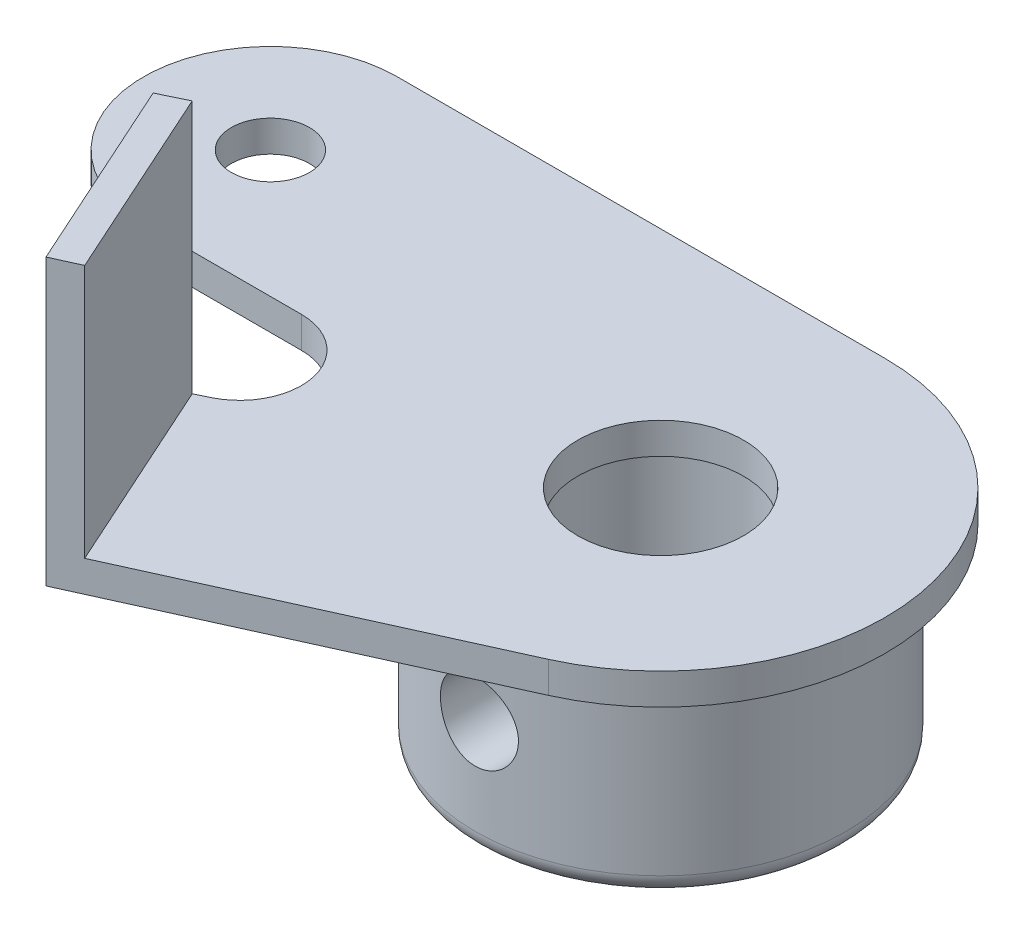
ISO-10303-21;
HEADER;
FILE_DESCRIPTION(('STEP AP214'),'2;1');
FILE_NAME('part.step','',(''),(''),'','','');
FILE_SCHEMA(('AUTOMOTIVE_DESIGN { 1 0 10303 214 1 1 1 1 }'));
ENDSEC;
DATA;
#1=APPLICATION_CONTEXT('core data for automotive mechanical design processes');
#2=APPLICATION_PROTOCOL_DEFINITION('international standard','automotive_design',2000,#1);
#3=PRODUCT_CONTEXT('',#1,'mechanical');
#4=PRODUCT('Part','Part','',(#3));
#5=PRODUCT_RELATED_PRODUCT_CATEGORY('part','',(#4));
#6=PRODUCT_DEFINITION_FORMATION('','',#4);
#7=PRODUCT_DEFINITION_CONTEXT('part definition',#1,'design');
#8=PRODUCT_DEFINITION('design','',#6,#7);
#9=PRODUCT_DEFINITION_SHAPE('','',#8);
#10=(LENGTH_UNIT() NAMED_UNIT(*) SI_UNIT(.MILLI.,.METRE.));
#11=(NAMED_UNIT(*) PLANE_ANGLE_UNIT() SI_UNIT($,.RADIAN.));
#12=(NAMED_UNIT(*) SI_UNIT($,.STERADIAN.) SOLID_ANGLE_UNIT());
#13=UNCERTAINTY_MEASURE_WITH_UNIT(LENGTH_MEASURE(1.E-05),#10,'distance_accuracy_value','');
#14=(GEOMETRIC_REPRESENTATION_CONTEXT(3) GLOBAL_UNCERTAINTY_ASSIGNED_CONTEXT((#13)) GLOBAL_UNIT_ASSIGNED_CONTEXT((#10,
#11,#12)) REPRESENTATION_CONTEXT('',''));
#15=CARTESIAN_POINT('',(0.,0.,0.));
#16=DIRECTION('',(0.,0.,1.));
#17=DIRECTION('',(1.,0.,0.));
#18=AXIS2_PLACEMENT_3D('',#15,#16,#17);
#19=CARTESIAN_POINT('',(0.,-9.9,0.));
#20=DIRECTION('',(0.,1.,0.));
#21=DIRECTION('',(0.,0.,1.));
#22=AXIS2_PLACEMENT_3D('',#19,#20,#21);
#23=CYLINDRICAL_SURFACE('',#22,9.5);
#24=CARTESIAN_POINT('',(0.,0.,0.));
#25=DIRECTION('',(0.,1.,0.));
#26=DIRECTION('',(0.,0.,1.));
#27=AXIS2_PLACEMENT_3D('',#24,#25,#26);
#28=CIRCLE('',#27,9.5);
#29=CARTESIAN_POINT('',(0.,0.,9.5));
#30=VERTEX_POINT('',#29);
#31=EDGE_CURVE('E180',#30,#30,#28,.T.);
#32=ORIENTED_EDGE('',*,*,#31,.F.);
#33=EDGE_LOOP('',(#32));
#34=FACE_BOUND('',#33,.T.);
#35=CARTESIAN_POINT('',(0.,-8.9,0.));
#36=DIRECTION('',(0.,1.,0.));
#37=DIRECTION('',(0.,0.,1.));
#38=AXIS2_PLACEMENT_3D('',#35,#36,#37);
#39=CIRCLE('',#38,9.5);
#40=CARTESIAN_POINT('',(0.,-8.9,9.5));
#41=VERTEX_POINT('',#40);
#42=EDGE_CURVE('E54',#41,#41,#39,.T.);
#43=ORIENTED_EDGE('',*,*,#42,.T.);
#44=EDGE_LOOP('',(#43));
#45=FACE_BOUND('',#44,.T.);
#46=CARTESIAN_POINT('',(0.,-6.,9.5));
#47=CARTESIAN_POINT('',(-0.111027691406918,-5.99999607124184,9.49999794466284));
#48=CARTESIAN_POINT('',(-0.222103819697907,-5.99072341258494,9.49803374011152));
#49=CARTESIAN_POINT('',(-0.441107897677742,-5.95391221577523,9.49038773876543));
#50=CARTESIAN_POINT('',(-0.549033421548031,-5.92635997129166,9.48470315241122));
#51=CARTESIAN_POINT('',(-0.758538954356631,-5.85388532469072,9.47025014436966));
#52=CARTESIAN_POINT('',(-0.860125227252474,-5.80898039524809,9.46148482551806));
#53=CARTESIAN_POINT('',(-1.05431669556347,-5.70312896009559,9.44181943917345));
#54=CARTESIAN_POINT('',(-1.14692225767425,-5.64218310973783,9.43091945889674));
#55=CARTESIAN_POINT('',(-1.32191105664779,-5.5050163164218,9.40799939900276));
#56=CARTESIAN_POINT('',(-1.40414098477697,-5.42860195147082,9.39596628673028));
#57=CARTESIAN_POINT('',(-1.5547158009156,-5.26308274811662,9.37222932526175));
#58=CARTESIAN_POINT('',(-1.62305952179987,-5.17397684406892,9.36052550381352));
#59=CARTESIAN_POINT('',(-1.74458761331518,-4.98448418595307,9.33864435582616));
#60=CARTESIAN_POINT('',(-1.79761077433325,-4.88399193875563,9.3284837610875));
#61=CARTESIAN_POINT('',(-1.88595912909311,-4.67527480153637,9.31102569552844));
#62=CARTESIAN_POINT('',(-1.92128627263874,-4.56705076492994,9.30372790929388));
#63=CARTESIAN_POINT('',(-1.97273711798377,-4.34759918793632,9.29295410063532));
#64=CARTESIAN_POINT('',(-1.98913117149676,-4.23643772602986,9.28942433018121));
#65=CARTESIAN_POINT('',(-2.00309070126667,-4.01289040972181,9.28642462929545));
#66=CARTESIAN_POINT('',(-2.0006583162811,-3.90050469584858,9.28695423770231));
#67=CARTESIAN_POINT('',(-1.97725203465241,-3.67969454311813,9.29196471678557));
#68=CARTESIAN_POINT('',(-1.95659032965632,-3.57123527450766,9.29637905513068));
#69=CARTESIAN_POINT('',(-1.89780570602233,-3.35935778687936,9.30855661318396));
#70=CARTESIAN_POINT('',(-1.85968187273537,-3.25593983223457,9.31632000831117));
#71=CARTESIAN_POINT('',(-1.76676342524457,-3.05619311586893,9.3343876042841));
#72=CARTESIAN_POINT('',(-1.71184711583088,-2.95992270171329,9.34471024508934));
#73=CARTESIAN_POINT('',(-1.58698828724243,-2.77784720736976,9.36672168799341));
#74=CARTESIAN_POINT('',(-1.51704386320572,-2.6920434560286,9.37841066319381));
#75=CARTESIAN_POINT('',(-1.36245319268555,-2.5315377182517,9.40212443418224));
#76=CARTESIAN_POINT('',(-1.27754103078861,-2.45709191372292,9.41415127237563));
#77=CARTESIAN_POINT('',(-1.09630350618647,-2.32345749428508,9.43697235772124));
#78=CARTESIAN_POINT('',(-0.999977965203844,-2.26426911774351,9.44776658561488));
#79=CARTESIAN_POINT('',(-0.798347946602956,-2.16277357067253,9.4669373217246));
#80=CARTESIAN_POINT('',(-0.693027080487019,-2.12049804546326,9.47530928967255));
#81=CARTESIAN_POINT('',(-0.476561722422704,-2.05431411167283,9.48865817597072));
#82=CARTESIAN_POINT('',(-0.36541801587004,-2.0304032328119,9.49363555092699));
#83=CARTESIAN_POINT('',(-0.142661179143838,-2.00199549360385,9.49957007213675));
#84=CARTESIAN_POINT('',(-0.0310945881093398,-1.9971484028368,9.50059973479178));
#85=CARTESIAN_POINT('',(0.191254168004883,-2.00605926966534,9.49872522451051));
#86=CARTESIAN_POINT('',(0.302036381746439,-2.01981606274954,9.49582129779749));
#87=CARTESIAN_POINT('',(0.518524951939024,-2.06525350407423,9.48645148769872));
#88=CARTESIAN_POINT('',(0.624271191689803,-2.0967522431248,9.48002177185877));
#89=CARTESIAN_POINT('',(0.828980163564159,-2.17657893621449,9.46431934896414));
#90=CARTESIAN_POINT('',(0.927942347168736,-2.22490824915882,9.45504641235425));
#91=CARTESIAN_POINT('',(1.1177352139125,-2.33776641280824,9.43450639350328));
#92=CARTESIAN_POINT('',(1.20843942082223,-2.40250330603654,9.42321429613729));
#93=CARTESIAN_POINT('',(1.3778228093732,-2.5460629854693,9.39994292264559));
#94=CARTESIAN_POINT('',(1.45650054987901,-2.62488745734182,9.38796356440136));
#95=CARTESIAN_POINT('',(1.60096761890465,-2.7959863577544,9.36442002668555));
#96=CARTESIAN_POINT('',(1.66651533299618,-2.88846649855883,9.35286635532256));
#97=CARTESIAN_POINT('',(1.78114871532168,-3.08332921929841,9.3317158615554));
#98=CARTESIAN_POINT('',(1.83023507526625,-3.1857113829149,9.32211895693401));
#99=CARTESIAN_POINT('',(1.91023404895235,-3.39693504714075,9.30605568943114));
#100=CARTESIAN_POINT('',(1.94124569603787,-3.50573768219553,9.29957230236649));
#101=CARTESIAN_POINT('',(1.98450997561557,-3.72716231931549,9.29043690813401));
#102=CARTESIAN_POINT('',(1.99676535636039,-3.83978375935983,9.2877843396606));
#103=CARTESIAN_POINT('',(2.00205901839309,-4.06321772699636,9.28664441918933));
#104=CARTESIAN_POINT('',(1.99547977904067,-4.17402094367414,9.28807416506268));
#105=CARTESIAN_POINT('',(1.96414112828371,-4.39290256994455,9.29475130102582));
#106=CARTESIAN_POINT('',(1.93938189936145,-4.50098100687599,9.29999865279627));
#107=CARTESIAN_POINT('',(1.87256463307709,-4.71106838455512,9.31368082515299));
#108=CARTESIAN_POINT('',(1.83055834216923,-4.81309444519955,9.32210610488688));
#109=CARTESIAN_POINT('',(1.7304853373043,-5.00870903307655,9.34119928093713));
#110=CARTESIAN_POINT('',(1.67241709412298,-5.10229675578741,9.35186739076535));
#111=CARTESIAN_POINT('',(1.54058300352461,-5.28027215313688,9.37449454781844));
#112=CARTESIAN_POINT('',(1.46654292423916,-5.36445412742039,9.38647407045747));
#113=CARTESIAN_POINT('',(1.30542742412966,-5.51932471088921,9.41023256612317));
#114=CARTESIAN_POINT('',(1.21834900426412,-5.59001020712048,9.42201149231316));
#115=CARTESIAN_POINT('',(1.0323889870608,-5.71667699825411,9.44420645110714));
#116=CARTESIAN_POINT('',(0.933379984354338,-5.77247451681065,9.45460471891947));
#117=CARTESIAN_POINT('',(0.727194538068344,-5.86654901797898,9.47269018370409));
#118=CARTESIAN_POINT('',(0.620025269870786,-5.90484119029407,9.48037972974824));
#119=CARTESIAN_POINT('',(0.427239257105932,-5.95572669428031,9.49075437069452));
#120=CARTESIAN_POINT('',(0.34269090067951,-5.97229845081316,9.4942005429971));
#121=CARTESIAN_POINT('',(0.172104693356146,-5.99443641509507,9.49882411071615));
#122=CARTESIAN_POINT('',(0.0860668997910729,-6.00000304551082,9.50000159326466));
#123=CARTESIAN_POINT('',(0.,-6.,9.5));
#124=B_SPLINE_CURVE_WITH_KNOTS('',3,(#46,#47,#48,#49,#50,#51,#52,#53,#54,#55,#56,#57,#58,#59,
#60,#61,#62,#63,#64,#65,#66,#67,#68,#69,#70,#71,#72,#73,#74,#75,#76,#77,#78,#79,#80,#81,#82,#83,
#84,#85,#86,#87,#88,#89,#90,#91,#92,#93,#94,#95,#96,#97,#98,#99,#100,#101,#102,#103,#104,#105,
#106,#107,#108,#109,#110,#111,#112,#113,#114,#115,#116,#117,#118,#119,#120,#121,#122,#123),
.UNSPECIFIED.,.T.,.F.,(4,2,2,2,2,2,2,2,2,2,2,2,2,2,2,2,2,2,2,2,2,2,2,2,2,2,2,2,2,2,2,2,2,2,2,2,
2,2,4),(0.,0.332768117031277,0.665786031430695,0.998469495255918,1.33113936940165,
1.6682591973254,2.00540734820485,2.34598369082387,2.68652249939278,3.02213605752824,
3.35771148920196,3.68764911424788,4.01760402307771,4.35000918418411,4.68245650359801,
5.02154876866119,5.36064633105725,5.70037543797721,6.04005883898083,6.37347176163493,
6.7068638152502,7.03689822691305,7.36695929182639,7.70143535229664,8.03595146177539,
8.37614947767226,8.71633319656386,9.05463505055367,9.39288733028468,9.72431965754211,
10.0557486580815,10.3861904535976,10.7166637206083,11.0533410961237,11.3900960325031,
11.7308334079191,12.0712745555643,12.329241012877,12.5871975624483),.UNSPECIFIED.);
#125=CARTESIAN_POINT('',(0.,-6.,9.5));
#126=VERTEX_POINT('',#125);
#127=EDGE_CURVE('E168',#126,#126,#124,.T.);
#128=ORIENTED_EDGE('',*,*,#127,.T.);
#129=EDGE_LOOP('',(#128));
#130=FACE_BOUND('',#129,.T.);
#131=ADVANCED_FACE('F39',(#34,#45,#130),#23,.T.);
#132=CARTESIAN_POINT('',(0.,-9.9,0.));
#133=DIRECTION('',(0.,1.,0.));
#134=DIRECTION('',(0.,0.,1.));
#135=AXIS2_PLACEMENT_3D('',#132,#133,#134);
#136=CYLINDRICAL_SURFACE('',#135,4.5);
#137=CARTESIAN_POINT('',(0.,-9.9,0.));
#138=DIRECTION('',(0.,1.,0.));
#139=DIRECTION('',(0.,0.,1.));
#140=AXIS2_PLACEMENT_3D('',#137,#138,#139);
#141=CIRCLE('',#140,4.5);
#142=CARTESIAN_POINT('',(0.,-9.9,4.5));
#143=VERTEX_POINT('',#142);
#144=EDGE_CURVE('E176',#143,#143,#141,.T.);
#145=ORIENTED_EDGE('',*,*,#144,.F.);
#146=EDGE_LOOP('',(#145));
#147=FACE_BOUND('',#146,.T.);
#148=CARTESIAN_POINT('',(0.,0.,0.));
#149=DIRECTION('',(0.,1.,0.));
#150=DIRECTION('',(0.,0.,1.));
#151=AXIS2_PLACEMENT_3D('',#148,#149,#150);
#152=CIRCLE('',#151,4.5);
#153=CARTESIAN_POINT('',(0.,0.,4.5));
#154=VERTEX_POINT('',#153);
#155=EDGE_CURVE('E334',#154,#154,#152,.T.);
#156=ORIENTED_EDGE('',*,*,#155,.T.);
#157=EDGE_LOOP('',(#156));
#158=FACE_BOUND('',#157,.T.);
#159=CARTESIAN_POINT('',(0.,-6.,4.5));
#160=CARTESIAN_POINT('',(-0.106491721841544,-5.99999501758122,4.49999592201235));
#161=CARTESIAN_POINT('',(-0.21314990839859,-5.9914445549547,4.49617759862479));
#162=CARTESIAN_POINT('',(-0.423397791553031,-5.95758155510822,4.48128347117207));
#163=CARTESIAN_POINT('',(-0.52697948867481,-5.93222874127921,4.4701902292036));
#164=CARTESIAN_POINT('',(-0.727700457039998,-5.86589953450088,4.44192390608473));
#165=CARTESIAN_POINT('',(-0.824861278500743,-5.82497888321389,4.4247725319732));
#166=CARTESIAN_POINT('',(-1.01083182992513,-5.72892471805294,4.38602940690416));
#167=CARTESIAN_POINT('',(-1.09964345718941,-5.67379444393081,4.36443866833523));
#168=CARTESIAN_POINT('',(-1.27147987858137,-5.54766515992118,4.31759990391248));
#169=CARTESIAN_POINT('',(-1.35398160775404,-5.47600235690455,4.29222181537651));
#170=CARTESIAN_POINT('',(-1.50625667860228,-5.32025173671296,4.24118529786287));
#171=CARTESIAN_POINT('',(-1.57602243299506,-5.23615656675937,4.21552671136583));
#172=CARTESIAN_POINT('',(-1.70484606406972,-5.05206127800161,4.16516047349691));
#173=CARTESIAN_POINT('',(-1.76305311381034,-4.95142318568418,4.14059326444591));
#174=CARTESIAN_POINT('',(-1.86148058259834,-4.74054475309348,4.09729211094913));
#175=CARTESIAN_POINT('',(-1.90171150191227,-4.6303100634953,4.07855476309651));
#176=CARTESIAN_POINT('',(-1.96081152395391,-4.40937961957922,4.05046224857976));
#177=CARTESIAN_POINT('',(-1.98069316967171,-4.29901326559807,4.04066532542944));
#178=CARTESIAN_POINT('',(-2.00167828313022,-4.07611022983535,4.03031463933106));
#179=CARTESIAN_POINT('',(-2.00279429210704,-3.9635750478577,4.02975470323001));
#180=CARTESIAN_POINT('',(-1.98697164299089,-3.75030455137066,4.03757276711961));
#181=CARTESIAN_POINT('',(-1.97164003901053,-3.64941463083007,4.04515525710506));
#182=CARTESIAN_POINT('',(-1.92608101262575,-3.45182477504366,4.06704362044732));
#183=CARTESIAN_POINT('',(-1.89585024271053,-3.35512578672126,4.08135100470464));
#184=CARTESIAN_POINT('',(-1.82075207125291,-3.16606637226809,4.11540857141477));
#185=CARTESIAN_POINT('',(-1.77557135736335,-3.07385205485914,4.13527371795058));
#186=CARTESIAN_POINT('',(-1.67208117489408,-2.89792408552561,4.1781907832441));
#187=CARTESIAN_POINT('',(-1.61376617867147,-2.81421403425943,4.20124404215704));
#188=CARTESIAN_POINT('',(-1.47900808503927,-2.64908639852289,4.25066638916311));
#189=CARTESIAN_POINT('',(-1.40135242758352,-2.5686865215826,4.2771397203327));
#190=CARTESIAN_POINT('',(-1.23343821212405,-2.42168255644264,4.32854899612318));
#191=CARTESIAN_POINT('',(-1.14317585772422,-2.35508263904009,4.3534844743602));
#192=CARTESIAN_POINT('',(-0.949152758511854,-2.23578677227797,4.39992448973313));
#193=CARTESIAN_POINT('',(-0.84507203759896,-2.18355965680664,4.42130591930767));
#194=CARTESIAN_POINT('',(-0.628407422866467,-2.09772305008782,4.45725580673344));
#195=CARTESIAN_POINT('',(-0.515828940708057,-2.06410182177702,4.47182855876463));
#196=CARTESIAN_POINT('',(-0.293820535494528,-2.01868811731395,4.4916825843904));
#197=CARTESIAN_POINT('',(-0.184721163041697,-2.00553330274902,4.49754246102964));
#198=CARTESIAN_POINT('',(0.034277038790982,-1.99729687693117,4.5012000386526));
#199=CARTESIAN_POINT('',(0.144175583963884,-2.00220912686501,4.49900047806663));
#200=CARTESIAN_POINT('',(0.354907416738488,-2.02904357268083,4.48715295545649));
#201=CARTESIAN_POINT('',(0.455896417732649,-2.04996089251949,4.47794517757649));
#202=CARTESIAN_POINT('',(0.652792072958493,-2.10675797910305,4.45350542314086));
#203=CARTESIAN_POINT('',(0.748698107925826,-2.14263956426254,4.43827271446453));
#204=CARTESIAN_POINT('',(0.936104051933314,-2.2294888824104,4.40262377340665));
#205=CARTESIAN_POINT('',(1.02737315333644,-2.28089234711435,4.38206065228313));
#206=CARTESIAN_POINT('',(1.20031927875008,-2.39685142601791,4.33788123051325));
#207=CARTESIAN_POINT('',(1.28199210078393,-2.46141276814545,4.31426360181097));
#208=CARTESIAN_POINT('',(1.44036721253598,-2.60791677979857,4.26412793153243));
#209=CARTESIAN_POINT('',(1.5161383873979,-2.69084093748011,4.23752954099254));
#210=CARTESIAN_POINT('',(1.65300242266305,-2.86855534031592,4.18604134951667));
#211=CARTESIAN_POINT('',(1.71409007929176,-2.96334977419537,4.16115215653839));
#212=CARTESIAN_POINT('',(1.8210757313739,-3.16512430780775,4.11547790156447));
#213=CARTESIAN_POINT('',(1.86658327729173,-3.27233831636332,4.09480296069982));
#214=CARTESIAN_POINT('',(1.9384649201629,-3.4941268153095,4.06127502800889));
#215=CARTESIAN_POINT('',(1.96485774363289,-3.60869398173067,4.04841438258477));
#216=CARTESIAN_POINT('',(1.99578547827111,-3.83148157617779,4.03325053556433));
#217=CARTESIAN_POINT('',(2.00198344684389,-3.93941687852725,4.03014488230275));
#218=CARTESIAN_POINT('',(1.99690774864711,-4.15475960320147,4.03266289201163));
#219=CARTESIAN_POINT('',(1.9856378074246,-4.26216713318831,4.03828469359531));
#220=CARTESIAN_POINT('',(1.94740226605598,-4.46669192726576,4.056849647764));
#221=CARTESIAN_POINT('',(1.92142172220812,-4.56403951904575,4.06933199333214));
#222=CARTESIAN_POINT('',(1.85554194393926,-4.75298191903924,4.09978946876219));
#223=CARTESIAN_POINT('',(1.81563868559956,-4.84457505506902,4.11776618641145));
#224=CARTESIAN_POINT('',(1.72012109921673,-5.02583760828885,4.15861055539882));
#225=CARTESIAN_POINT('',(1.66366385858237,-5.11500764977681,4.18171780090031));
#226=CARTESIAN_POINT('',(1.53773594407697,-5.28312481334675,4.22964589951755));
#227=CARTESIAN_POINT('',(1.46825983476651,-5.36206764215037,4.25446746562723));
#228=CARTESIAN_POINT('',(1.31108140365532,-5.51462241319819,4.30563232874031));
#229=CARTESIAN_POINT('',(1.22231636253249,-5.58716396303648,4.33191880579014));
#230=CARTESIAN_POINT('',(1.03295134905358,-5.71643521702799,4.38093190708684));
#231=CARTESIAN_POINT('',(0.932345999936719,-5.77315769793594,4.40365690303547));
#232=CARTESIAN_POINT('',(0.723051823292369,-5.86822386265644,4.44279207455561));
#233=CARTESIAN_POINT('',(0.61446726176612,-5.90676811008318,4.45927074863036));
#234=CARTESIAN_POINT('',(0.391615018990365,-5.96463975047681,4.48431907433046));
#235=CARTESIAN_POINT('',(0.277365804280791,-5.98402576384635,4.49291284638178));
#236=CARTESIAN_POINT('',(0.135356670708527,-5.9955997263474,4.4980461865859));
#237=CARTESIAN_POINT('',(0.108319935768286,-5.99724828858674,4.49877760770441));
#238=CARTESIAN_POINT('',(0.0541923948081839,-5.99944906578034,4.49975503614401));
#239=CARTESIAN_POINT('',(0.0271015881639021,-6.00000126799961,4.5000010378266));
#240=CARTESIAN_POINT('',(0.,-6.,4.5));
#241=B_SPLINE_CURVE_WITH_KNOTS('',3,(#159,#160,#161,#162,#163,#164,#165,#166,#167,#168,#169,
#170,#171,#172,#173,#174,#175,#176,#177,#178,#179,#180,#181,#182,#183,#184,#185,#186,#187,#188,
#189,#190,#191,#192,#193,#194,#195,#196,#197,#198,#199,#200,#201,#202,#203,#204,#205,#206,#207,
#208,#209,#210,#211,#212,#213,#214,#215,#216,#217,#218,#219,#220,#221,#222,#223,#224,#225,#226,
#227,#228,#229,#230,#231,#232,#233,#234,#235,#236,#237,#238,#239,#240),.UNSPECIFIED.,.T.,.F.,(4,
2,2,2,2,2,2,2,2,2,2,2,2,2,2,2,2,2,2,2,2,2,2,2,2,2,2,2,2,2,2,2,2,2,2,2,2,2,2,2,4),(0.,
0.319363757820221,0.639495839039849,0.958492293098604,1.27741608114945,1.61253910860028,
1.9478611340991,2.30254396540812,2.65701934670053,2.99284475492684,3.32844571922349,
3.63400850030665,3.93963996586078,4.25213185320658,4.56475550123122,4.90783346749843,
5.25101497234173,5.6043339590265,5.95742980836633,6.28582812976761,6.61411487855049,
6.92332786204155,7.23257843116074,7.5514769554366,7.87051460127432,8.2152651666866,
8.56013773064322,8.9131101564671,9.26573630896653,9.58847399859333,9.91114286435878,
10.214399649514,10.5177441541184,10.8405269704428,11.1634448516016,11.5146101835415,
11.8659356017472,12.2132884514089,12.5595751486184,12.6408506163643,12.7221270281759),.UNSPECIFIED.);
#242=CARTESIAN_POINT('',(0.,-6.,4.5));
#243=VERTEX_POINT('',#242);
#244=EDGE_CURVE('E43',#243,#243,#241,.T.);
#245=ORIENTED_EDGE('',*,*,#244,.F.);
#246=EDGE_LOOP('',(#245));
#247=FACE_BOUND('',#246,.T.);
#248=ADVANCED_FACE('F254',(#147,#158,#247),#136,.F.);
#249=CARTESIAN_POINT('',(0.,0.,0.));
#250=DIRECTION('',(0.,1.,0.));
#251=DIRECTION('',(0.,0.,1.));
#252=AXIS2_PLACEMENT_3D('',#249,#250,#251);
#253=PLANE('',#252);
#254=CARTESIAN_POINT('',(0.,0.,0.));
#255=DIRECTION('',(0.,1.,0.));
#256=DIRECTION('',(0.,0.,1.));
#257=AXIS2_PLACEMENT_3D('',#254,#255,#256);
#258=CIRCLE('',#257,4.25);
#259=CARTESIAN_POINT('',(0.,0.,4.25));
#260=VERTEX_POINT('',#259);
#261=EDGE_CURVE('E186',#260,#260,#258,.T.);
#262=ORIENTED_EDGE('',*,*,#261,.T.);
#263=EDGE_LOOP('',(#262));
#264=FACE_BOUND('',#263,.T.);
#265=ORIENTED_EDGE('',*,*,#155,.F.);
#266=EDGE_LOOP('',(#265));
#267=FACE_BOUND('',#266,.T.);
#268=ADVANCED_FACE('F256',(#264,#267),#253,.F.);
#269=CARTESIAN_POINT('',(0.,1.6,0.));
#270=DIRECTION('',(0.,1.,0.));
#271=DIRECTION('',(0.,0.,1.));
#272=AXIS2_PLACEMENT_3D('',#269,#270,#271);
#273=PLANE('',#272);
#274=DIRECTION('',(-0.412042177364769,0.,-0.911164773283351));
#275=VECTOR('',#274,1.);
#276=CARTESIAN_POINT('',(-16.1820359982028,1.6,7.82423700244424));
#277=LINE('',#276,#275);
#278=CARTESIAN_POINT('',(-11.6337033913184,1.6,17.8821404798842));
#279=VERTEX_POINT('',#278);
#280=CARTESIAN_POINT('',(-16.1820359982028,1.6,7.82423700244424));
#281=VERTEX_POINT('',#280);
#282=EDGE_CURVE('E62',#279,#281,#277,.T.);
#283=ORIENTED_EDGE('',*,*,#282,.F.);
#284=DIRECTION('',(0.911164773283351,0.,-0.412042177364769));
#285=VECTOR('',#284,1.);
#286=CARTESIAN_POINT('',(4.73848503969484,1.6,10.4783948927585));
#287=LINE('',#286,#285);
#288=CARTESIAN_POINT('',(4.73848503969484,1.6,10.4783948927585));
#289=VERTEX_POINT('',#288);
#290=EDGE_CURVE('E67',#279,#289,#287,.T.);
#291=ORIENTED_EDGE('',*,*,#290,.T.);
#292=CARTESIAN_POINT('',(0.,1.6,0.));
#293=DIRECTION('',(0.,1.,0.));
#294=DIRECTION('',(0.,0.,1.));
#295=AXIS2_PLACEMENT_3D('',#292,#293,#294);
#296=CIRCLE('',#295,11.5);
#297=CARTESIAN_POINT('',(0.,1.6,-11.5));
#298=VERTEX_POINT('',#297);
#299=EDGE_CURVE('E199',#289,#298,#296,.T.);
#300=ORIENTED_EDGE('',*,*,#299,.T.);
#301=DIRECTION('',(-1.,0.,0.));
#302=VECTOR('',#301,1.);
#303=CARTESIAN_POINT('',(0.,1.6,-11.5));
#304=LINE('',#303,#302);
#305=CARTESIAN_POINT('',(-25.,1.6,-11.5));
#306=VERTEX_POINT('',#305);
#307=EDGE_CURVE('E110',#298,#306,#304,.T.);
#308=ORIENTED_EDGE('',*,*,#307,.T.);
#309=CARTESIAN_POINT('',(-25.,1.6,-4.99999999999999));
#310=DIRECTION('',(0.,1.,0.));
#311=DIRECTION('',(0.,0.,1.));
#312=AXIS2_PLACEMENT_3D('',#309,#310,#311);
#313=CIRCLE('',#312,6.50000000000001);
#314=CARTESIAN_POINT('',(-25.,1.6,1.50000000000001));
#315=VERTEX_POINT('',#314);
#316=EDGE_CURVE('E128',#306,#315,#313,.T.);
#317=ORIENTED_EDGE('',*,*,#316,.T.);
#318=DIRECTION('',(1.,0.,0.));
#319=VECTOR('',#318,1.);
#320=CARTESIAN_POINT('',(-25.,1.6,1.50000000000001));
#321=LINE('',#320,#319);
#322=CARTESIAN_POINT('',(-16.9092175399438,1.6,1.50000000000001));
#323=VERTEX_POINT('',#322);
#324=EDGE_CURVE('E120',#315,#323,#321,.T.);
#325=ORIENTED_EDGE('',*,*,#324,.T.);
#326=CARTESIAN_POINT('',(-16.9092175399438,1.6,4.66276717832938));
#327=DIRECTION('',(0.,-1.,0.));
#328=DIRECTION('',(0.,0.,-1.));
#329=AXIS2_PLACEMENT_3D('',#326,#327,#328);
#330=CIRCLE('',#329,3.16276717832936);
#331=CARTESIAN_POINT('',(-15.5324639510125,1.6,7.51015998222599));
#332=VERTEX_POINT('',#331);
#333=EDGE_CURVE('E125',#323,#332,#330,.T.);
#334=ORIENTED_EDGE('',*,*,#333,.T.);
#335=DIRECTION('',(-0.90028530187311,0.,0.435300327625931));
#336=VECTOR('',#335,1.);
#337=CARTESIAN_POINT('',(-15.5324639510125,1.6,7.51015998222599));
#338=LINE('',#337,#336);
#339=EDGE_CURVE('E149',#332,#281,#338,.T.);
#340=ORIENTED_EDGE('',*,*,#339,.T.);
#341=EDGE_LOOP('',(#283,#291,#300,#308,#317,#325,#334,#340));
#342=FACE_BOUND('',#341,.T.);
#343=CARTESIAN_POINT('',(-25.,1.6,-4.99999999999999));
#344=DIRECTION('',(0.,1.,0.));
#345=DIRECTION('',(0.,0.,1.));
#346=AXIS2_PLACEMENT_3D('',#343,#344,#345);
#347=CIRCLE('',#346,2.);
#348=CARTESIAN_POINT('',(-25.,1.6,-2.99999999999999));
#349=VERTEX_POINT('',#348);
#350=EDGE_CURVE('E182',#349,#349,#347,.T.);
#351=ORIENTED_EDGE('',*,*,#350,.F.);
#352=EDGE_LOOP('',(#351));
#353=FACE_BOUND('',#352,.T.);
#354=CARTESIAN_POINT('',(0.,1.6,0.));
#355=DIRECTION('',(0.,1.,0.));
#356=DIRECTION('',(0.,0.,1.));
#357=AXIS2_PLACEMENT_3D('',#354,#355,#356);
#358=CIRCLE('',#357,4.25);
#359=CARTESIAN_POINT('',(0.,1.6,4.25));
#360=VERTEX_POINT('',#359);
#361=EDGE_CURVE('E191',#360,#360,#358,.T.);
#362=ORIENTED_EDGE('',*,*,#361,.F.);
#363=EDGE_LOOP('',(#362));
#364=FACE_BOUND('',#363,.T.);
#365=ADVANCED_FACE('F122',(#342,#353,#364),#273,.T.);
#366=ORIENTED_EDGE('',*,*,#31,.T.);
#367=EDGE_LOOP('',(#366));
#368=FACE_BOUND('',#367,.T.);
#369=CARTESIAN_POINT('',(0.,0.,0.));
#370=DIRECTION('',(0.,1.,0.));
#371=DIRECTION('',(0.,0.,1.));
#372=AXIS2_PLACEMENT_3D('',#369,#370,#371);
#373=CIRCLE('',#372,11.5);
#374=CARTESIAN_POINT('',(4.73848503969484,0.,10.4783948927585));
#375=VERTEX_POINT('',#374);
#376=CARTESIAN_POINT('',(0.,0.,-11.5));
#377=VERTEX_POINT('',#376);
#378=EDGE_CURVE('E195',#375,#377,#373,.T.);
#379=ORIENTED_EDGE('',*,*,#378,.F.);
#380=DIRECTION('',(0.911164773283351,0.,-0.412042177364769));
#381=VECTOR('',#380,1.);
#382=CARTESIAN_POINT('',(4.73848503969484,0.,10.4783948927585));
#383=LINE('',#382,#381);
#384=CARTESIAN_POINT('',(-13.,0.,18.5));
#385=VERTEX_POINT('',#384);
#386=EDGE_CURVE('E101',#385,#375,#383,.T.);
#387=ORIENTED_EDGE('',*,*,#386,.F.);
#388=DIRECTION('',(0.412042177364769,0.,0.911164773283351));
#389=VECTOR('',#388,1.);
#390=CARTESIAN_POINT('',(-17.5324639510125,0.,8.47718749388314));
#391=LINE('',#390,#389);
#392=CARTESIAN_POINT('',(-17.5324639510125,0.,8.47718749388314));
#393=VERTEX_POINT('',#392);
#394=EDGE_CURVE('E206',#393,#385,#391,.T.);
#395=ORIENTED_EDGE('',*,*,#394,.F.);
#396=DIRECTION('',(-0.90028530187311,0.,0.435300327625931));
#397=VECTOR('',#396,1.);
#398=CARTESIAN_POINT('',(-15.5324639510125,0.,7.51015998222599));
#399=LINE('',#398,#397);
#400=CARTESIAN_POINT('',(-15.5324639510125,0.,7.51015998222599));
#401=VERTEX_POINT('',#400);
#402=EDGE_CURVE('E209',#401,#393,#399,.T.);
#403=ORIENTED_EDGE('',*,*,#402,.F.);
#404=CARTESIAN_POINT('',(-16.9092175399438,0.,4.66276717832938));
#405=DIRECTION('',(0.,-1.,0.));
#406=DIRECTION('',(0.,0.,-1.));
#407=AXIS2_PLACEMENT_3D('',#404,#405,#406);
#408=CIRCLE('',#407,3.16276717832936);
#409=CARTESIAN_POINT('',(-16.9092175399438,0.,1.50000000000001));
#410=VERTEX_POINT('',#409);
#411=EDGE_CURVE('E212',#410,#401,#408,.T.);
#412=ORIENTED_EDGE('',*,*,#411,.F.);
#413=DIRECTION('',(1.,0.,0.));
#414=VECTOR('',#413,1.);
#415=CARTESIAN_POINT('',(-25.,0.,1.50000000000001));
#416=LINE('',#415,#414);
#417=CARTESIAN_POINT('',(-25.,0.,1.50000000000001));
#418=VERTEX_POINT('',#417);
#419=EDGE_CURVE('E138',#418,#410,#416,.T.);
#420=ORIENTED_EDGE('',*,*,#419,.F.);
#421=CARTESIAN_POINT('',(-25.,0.,-4.99999999999999));
#422=DIRECTION('',(0.,1.,0.));
#423=DIRECTION('',(0.,0.,1.));
#424=AXIS2_PLACEMENT_3D('',#421,#422,#423);
#425=CIRCLE('',#424,6.50000000000001);
#426=CARTESIAN_POINT('',(-25.,0.,-11.5));
#427=VERTEX_POINT('',#426);
#428=EDGE_CURVE('E217',#427,#418,#425,.T.);
#429=ORIENTED_EDGE('',*,*,#428,.F.);
#430=DIRECTION('',(-1.,0.,0.));
#431=VECTOR('',#430,1.);
#432=CARTESIAN_POINT('',(0.,0.,-11.5));
#433=LINE('',#432,#431);
#434=EDGE_CURVE('E220',#377,#427,#433,.T.);
#435=ORIENTED_EDGE('',*,*,#434,.F.);
#436=EDGE_LOOP('',(#379,#387,#395,#403,#412,#420,#429,#435));
#437=FACE_BOUND('',#436,.T.);
#438=CARTESIAN_POINT('',(-25.,0.,-4.99999999999999));
#439=DIRECTION('',(0.,1.,0.));
#440=DIRECTION('',(0.,0.,1.));
#441=AXIS2_PLACEMENT_3D('',#438,#439,#440);
#442=CIRCLE('',#441,2.);
#443=CARTESIAN_POINT('',(-25.,0.,-2.99999999999999));
#444=VERTEX_POINT('',#443);
#445=EDGE_CURVE('E187',#444,#444,#442,.T.);
#446=ORIENTED_EDGE('',*,*,#445,.T.);
#447=EDGE_LOOP('',(#446));
#448=FACE_BOUND('',#447,.T.);
#449=ADVANCED_FACE('F264',(#368,#437,#448),#253,.F.);
#450=CARTESIAN_POINT('',(0.,1.6,0.));
#451=DIRECTION('',(0.,-1.,0.));
#452=DIRECTION('',(0.,0.,-1.));
#453=AXIS2_PLACEMENT_3D('',#450,#451,#452);
#454=CYLINDRICAL_SURFACE('',#453,11.5);
#455=ORIENTED_EDGE('',*,*,#378,.T.);
#456=DIRECTION('',(0.,-1.,0.));
#457=VECTOR('',#456,1.);
#458=CARTESIAN_POINT('',(0.,1.6,-11.5));
#459=LINE('',#458,#457);
#460=EDGE_CURVE('E331',#298,#377,#459,.T.);
#461=ORIENTED_EDGE('',*,*,#460,.F.);
#462=ORIENTED_EDGE('',*,*,#299,.F.);
#463=DIRECTION('',(0.,-1.,0.));
#464=VECTOR('',#463,1.);
#465=CARTESIAN_POINT('',(4.73848503969484,1.6,10.4783948927585));
#466=LINE('',#465,#464);
#467=EDGE_CURVE('E163',#289,#375,#466,.T.);
#468=ORIENTED_EDGE('',*,*,#467,.T.);
#469=EDGE_LOOP('',(#455,#461,#462,#468));
#470=FACE_BOUND('',#469,.T.);
#471=ADVANCED_FACE('F426',(#470),#454,.T.);
#472=CARTESIAN_POINT('',(0.,1.6,-11.5));
#473=DIRECTION('',(0.,0.,1.));
#474=DIRECTION('',(1.,0.,0.));
#475=AXIS2_PLACEMENT_3D('',#472,#473,#474);
#476=PLANE('',#475);
#477=ORIENTED_EDGE('',*,*,#434,.T.);
#478=DIRECTION('',(0.,-1.,0.));
#479=VECTOR('',#478,1.);
#480=CARTESIAN_POINT('',(-25.,1.6,-11.5));
#481=LINE('',#480,#479);
#482=EDGE_CURVE('E327',#306,#427,#481,.T.);
#483=ORIENTED_EDGE('',*,*,#482,.F.);
#484=ORIENTED_EDGE('',*,*,#307,.F.);
#485=ORIENTED_EDGE('',*,*,#460,.T.);
#486=EDGE_LOOP('',(#477,#483,#484,#485));
#487=FACE_BOUND('',#486,.T.);
#488=ADVANCED_FACE('F432',(#487),#476,.F.);
#489=CARTESIAN_POINT('',(-25.,1.6,-4.99999999999999));
#490=DIRECTION('',(0.,-1.,0.));
#491=DIRECTION('',(0.,0.,-1.));
#492=AXIS2_PLACEMENT_3D('',#489,#490,#491);
#493=CYLINDRICAL_SURFACE('',#492,6.50000000000001);
#494=ORIENTED_EDGE('',*,*,#428,.T.);
#495=DIRECTION('',(0.,-1.,0.));
#496=VECTOR('',#495,1.);
#497=CARTESIAN_POINT('',(-25.,1.6,1.50000000000001));
#498=LINE('',#497,#496);
#499=EDGE_CURVE('E142',#315,#418,#498,.T.);
#500=ORIENTED_EDGE('',*,*,#499,.F.);
#501=ORIENTED_EDGE('',*,*,#316,.F.);
#502=ORIENTED_EDGE('',*,*,#482,.T.);
#503=EDGE_LOOP('',(#494,#500,#501,#502));
#504=FACE_BOUND('',#503,.T.);
#505=ADVANCED_FACE('F439',(#504),#493,.T.);
#506=CARTESIAN_POINT('',(-25.,1.6,1.50000000000001));
#507=DIRECTION('',(0.,0.,-1.));
#508=DIRECTION('',(-1.,0.,0.));
#509=AXIS2_PLACEMENT_3D('',#506,#507,#508);
#510=PLANE('',#509);
#511=ORIENTED_EDGE('',*,*,#419,.T.);
#512=DIRECTION('',(0.,-1.,0.));
#513=VECTOR('',#512,1.);
#514=CARTESIAN_POINT('',(-16.9092175399438,1.6,1.50000000000001));
#515=LINE('',#514,#513);
#516=EDGE_CURVE('E135',#323,#410,#515,.T.);
#517=ORIENTED_EDGE('',*,*,#516,.F.);
#518=ORIENTED_EDGE('',*,*,#324,.F.);
#519=ORIENTED_EDGE('',*,*,#499,.T.);
#520=EDGE_LOOP('',(#511,#517,#518,#519));
#521=FACE_BOUND('',#520,.T.);
#522=ADVANCED_FACE('F136',(#521),#510,.F.);
#523=CARTESIAN_POINT('',(-16.9092175399438,1.6,4.66276717832938));
#524=DIRECTION('',(0.,-1.,0.));
#525=DIRECTION('',(0.,0.,-1.));
#526=AXIS2_PLACEMENT_3D('',#523,#524,#525);
#527=CYLINDRICAL_SURFACE('',#526,3.16276717832936);
#528=ORIENTED_EDGE('',*,*,#411,.T.);
#529=DIRECTION('',(0.,-1.,0.));
#530=VECTOR('',#529,1.);
#531=CARTESIAN_POINT('',(-15.5324639510125,1.6,7.51015998222599));
#532=LINE('',#531,#530);
#533=EDGE_CURVE('E143',#332,#401,#532,.T.);
#534=ORIENTED_EDGE('',*,*,#533,.F.);
#535=ORIENTED_EDGE('',*,*,#333,.F.);
#536=ORIENTED_EDGE('',*,*,#516,.T.);
#537=EDGE_LOOP('',(#528,#534,#535,#536));
#538=FACE_BOUND('',#537,.T.);
#539=ADVANCED_FACE('F145',(#538),#527,.F.);
#540=CARTESIAN_POINT('',(-15.5324639510125,1.6,7.51015998222599));
#541=DIRECTION('',(0.435300327625931,0.,0.90028530187311));
#542=DIRECTION('',(0.90028530187311,0.,-0.435300327625931));
#543=AXIS2_PLACEMENT_3D('',#540,#541,#542);
#544=PLANE('',#543);
#545=ORIENTED_EDGE('',*,*,#402,.T.);
#546=DIRECTION('',(0.,-1.,0.));
#547=VECTOR('',#546,1.);
#548=CARTESIAN_POINT('',(-17.5324639510125,1.6,8.47718749388314));
#549=LINE('',#548,#547);
#550=CARTESIAN_POINT('',(-17.5324639510125,14.6,8.47718749388314));
#551=VERTEX_POINT('',#550);
#552=EDGE_CURVE('E307',#551,#393,#549,.T.);
#553=ORIENTED_EDGE('',*,*,#552,.F.);
#554=DIRECTION('',(-0.90028530187311,0.,0.435300327625931));
#555=VECTOR('',#554,1.);
#556=CARTESIAN_POINT('',(-16.1820359982028,14.6,7.82423700244424));
#557=LINE('',#556,#555);
#558=CARTESIAN_POINT('',(-16.1820359982028,14.6,7.82423700244424));
#559=VERTEX_POINT('',#558);
#560=EDGE_CURVE('E167',#559,#551,#557,.T.);
#561=ORIENTED_EDGE('',*,*,#560,.F.);
#562=DIRECTION('',(0.,-1.,0.));
#563=VECTOR('',#562,1.);
#564=CARTESIAN_POINT('',(-16.1820359982028,14.6,7.82423700244424));
#565=LINE('',#564,#563);
#566=EDGE_CURVE('E169',#559,#281,#565,.T.);
#567=ORIENTED_EDGE('',*,*,#566,.T.);
#568=ORIENTED_EDGE('',*,*,#339,.F.);
#569=ORIENTED_EDGE('',*,*,#533,.T.);
#570=EDGE_LOOP('',(#545,#553,#561,#567,#568,#569));
#571=FACE_BOUND('',#570,.T.);
#572=ADVANCED_FACE('F305',(#571),#544,.F.);
#573=CARTESIAN_POINT('',(-17.5324639510125,1.6,8.47718749388314));
#574=DIRECTION('',(0.911164773283351,0.,-0.412042177364769));
#575=DIRECTION('',(-0.412042177364769,0.,-0.911164773283351));
#576=AXIS2_PLACEMENT_3D('',#573,#574,#575);
#577=PLANE('',#576);
#578=ORIENTED_EDGE('',*,*,#394,.T.);
#579=DIRECTION('',(0.,-1.,0.));
#580=VECTOR('',#579,1.);
#581=CARTESIAN_POINT('',(-13.,1.6,18.5));
#582=LINE('',#581,#580);
#583=CARTESIAN_POINT('',(-13.,14.6,18.5));
#584=VERTEX_POINT('',#583);
#585=EDGE_CURVE('E313',#584,#385,#582,.T.);
#586=ORIENTED_EDGE('',*,*,#585,.F.);
#587=DIRECTION('',(0.412042177364769,0.,0.911164773283351));
#588=VECTOR('',#587,1.);
#589=CARTESIAN_POINT('',(-17.5324639510125,14.6,8.47718749388314));
#590=LINE('',#589,#588);
#591=EDGE_CURVE('E239',#551,#584,#590,.T.);
#592=ORIENTED_EDGE('',*,*,#591,.F.);
#593=ORIENTED_EDGE('',*,*,#552,.T.);
#594=EDGE_LOOP('',(#578,#586,#592,#593));
#595=FACE_BOUND('',#594,.T.);
#596=ADVANCED_FACE('F314',(#595),#577,.F.);
#597=CARTESIAN_POINT('',(4.73848503969484,1.6,10.4783948927585));
#598=DIRECTION('',(-0.412042177364769,0.,-0.911164773283351));
#599=DIRECTION('',(-0.911164773283351,0.,0.412042177364769));
#600=AXIS2_PLACEMENT_3D('',#597,#598,#599);
#601=PLANE('',#600);
#602=ORIENTED_EDGE('',*,*,#386,.T.);
#603=ORIENTED_EDGE('',*,*,#467,.F.);
#604=ORIENTED_EDGE('',*,*,#290,.F.);
#605=DIRECTION('',(0.,-1.,0.));
#606=VECTOR('',#605,1.);
#607=CARTESIAN_POINT('',(-11.6337033913184,14.6,17.8821404798842));
#608=LINE('',#607,#606);
#609=CARTESIAN_POINT('',(-11.6337033913184,14.6,17.8821404798842));
#610=VERTEX_POINT('',#609);
#611=EDGE_CURVE('E181',#610,#279,#608,.T.);
#612=ORIENTED_EDGE('',*,*,#611,.F.);
#613=DIRECTION('',(0.911164773283351,0.,-0.412042177364768));
#614=VECTOR('',#613,1.);
#615=CARTESIAN_POINT('',(-13.,14.6,18.5));
#616=LINE('',#615,#614);
#617=EDGE_CURVE('E236',#584,#610,#616,.T.);
#618=ORIENTED_EDGE('',*,*,#617,.F.);
#619=ORIENTED_EDGE('',*,*,#585,.T.);
#620=EDGE_LOOP('',(#602,#603,#604,#612,#618,#619));
#621=FACE_BOUND('',#620,.T.);
#622=ADVANCED_FACE('F364',(#621),#601,.F.);
#623=CARTESIAN_POINT('',(0.,1.6,0.));
#624=DIRECTION('',(0.,-1.,0.));
#625=DIRECTION('',(0.,0.,-1.));
#626=AXIS2_PLACEMENT_3D('',#623,#624,#625);
#627=CYLINDRICAL_SURFACE('',#626,4.25);
#628=ORIENTED_EDGE('',*,*,#361,.T.);
#629=EDGE_LOOP('',(#628));
#630=FACE_BOUND('',#629,.T.);
#631=ORIENTED_EDGE('',*,*,#261,.F.);
#632=EDGE_LOOP('',(#631));
#633=FACE_BOUND('',#632,.T.);
#634=ADVANCED_FACE('F387',(#630,#633),#627,.F.);
#635=CARTESIAN_POINT('',(-25.,1.6,-4.99999999999999));
#636=DIRECTION('',(0.,-1.,0.));
#637=DIRECTION('',(0.,0.,-1.));
#638=AXIS2_PLACEMENT_3D('',#635,#636,#637);
#639=CYLINDRICAL_SURFACE('',#638,2.);
#640=ORIENTED_EDGE('',*,*,#350,.T.);
#641=EDGE_LOOP('',(#640));
#642=FACE_BOUND('',#641,.T.);
#643=ORIENTED_EDGE('',*,*,#445,.F.);
#644=EDGE_LOOP('',(#643));
#645=FACE_BOUND('',#644,.T.);
#646=ADVANCED_FACE('F276',(#642,#645),#639,.F.);
#647=CARTESIAN_POINT('',(0.,-9.9,0.));
#648=DIRECTION('',(0.,1.,0.));
#649=DIRECTION('',(0.,0.,1.));
#650=AXIS2_PLACEMENT_3D('',#647,#648,#649);
#651=PLANE('',#650);
#652=CARTESIAN_POINT('',(0.,-9.9,0.));
#653=DIRECTION('',(0.,1.,0.));
#654=DIRECTION('',(0.,0.,1.));
#655=AXIS2_PLACEMENT_3D('',#652,#653,#654);
#656=CIRCLE('',#655,8.5);
#657=CARTESIAN_POINT('',(0.,-9.9,8.5));
#658=VERTEX_POINT('',#657);
#659=EDGE_CURVE('E11',#658,#658,#656,.F.);
#660=ORIENTED_EDGE('',*,*,#659,.T.);
#661=EDGE_LOOP('',(#660));
#662=FACE_BOUND('',#661,.T.);
#663=ORIENTED_EDGE('',*,*,#144,.T.);
#664=EDGE_LOOP('',(#663));
#665=FACE_BOUND('',#664,.T.);
#666=ADVANCED_FACE('F274',(#662,#665),#651,.F.);
#667=CARTESIAN_POINT('',(0.,-8.9,0.));
#668=DIRECTION('',(0.,1.,0.));
#669=DIRECTION('',(0.,0.,1.));
#670=AXIS2_PLACEMENT_3D('',#667,#668,#669);
#671=TOROIDAL_SURFACE('',#670,8.5,1.);
#672=ORIENTED_EDGE('',*,*,#659,.F.);
#673=EDGE_LOOP('',(#672));
#674=FACE_BOUND('',#673,.T.);
#675=ORIENTED_EDGE('',*,*,#42,.F.);
#676=EDGE_LOOP('',(#675));
#677=FACE_BOUND('',#676,.T.);
#678=ADVANCED_FACE('F41',(#674,#677),#671,.T.);
#679=CARTESIAN_POINT('',(-16.1820359982028,14.6,7.82423700244424));
#680=DIRECTION('',(-0.911164773283351,0.,0.412042177364769));
#681=DIRECTION('',(0.412042177364769,0.,0.911164773283351));
#682=AXIS2_PLACEMENT_3D('',#679,#680,#681);
#683=PLANE('',#682);
#684=ORIENTED_EDGE('',*,*,#282,.T.);
#685=ORIENTED_EDGE('',*,*,#566,.F.);
#686=DIRECTION('',(-0.412042177364769,0.,-0.911164773283351));
#687=VECTOR('',#686,1.);
#688=CARTESIAN_POINT('',(-16.1820359982028,14.6,7.82423700244424));
#689=LINE('',#688,#687);
#690=EDGE_CURVE('E174',#610,#559,#689,.T.);
#691=ORIENTED_EDGE('',*,*,#690,.F.);
#692=ORIENTED_EDGE('',*,*,#611,.T.);
#693=EDGE_LOOP('',(#684,#685,#691,#692));
#694=FACE_BOUND('',#693,.T.);
#695=ADVANCED_FACE('F272',(#694),#683,.F.);
#696=CARTESIAN_POINT('',(0.,14.6,0.));
#697=DIRECTION('',(0.,1.,0.));
#698=DIRECTION('',(0.,0.,1.));
#699=AXIS2_PLACEMENT_3D('',#696,#697,#698);
#700=PLANE('',#699);
#701=ORIENTED_EDGE('',*,*,#560,.T.);
#702=ORIENTED_EDGE('',*,*,#591,.T.);
#703=ORIENTED_EDGE('',*,*,#617,.T.);
#704=ORIENTED_EDGE('',*,*,#690,.T.);
#705=EDGE_LOOP('',(#701,#702,#703,#704));
#706=FACE_BOUND('',#705,.T.);
#707=ADVANCED_FACE('F286',(#706),#700,.T.);
#708=CARTESIAN_POINT('',(0.,-4.,18.5));
#709=DIRECTION('',(0.,0.,-1.));
#710=DIRECTION('',(-1.,0.,0.));
#711=AXIS2_PLACEMENT_3D('',#708,#709,#710);
#712=CYLINDRICAL_SURFACE('',#711,2.);
#713=ORIENTED_EDGE('',*,*,#127,.F.);
#714=EDGE_LOOP('',(#713));
#715=FACE_BOUND('',#714,.T.);
#716=ORIENTED_EDGE('',*,*,#244,.T.);
#717=EDGE_LOOP('',(#716));
#718=FACE_BOUND('',#717,.T.);
#719=ADVANCED_FACE('F252',(#715,#718),#712,.F.);
#720=CLOSED_SHELL('',(#131,#248,#268,#365,#449,#471,#488,#505,#522,#539,#572,#596,#622,#634,
#646,#666,#678,#695,#707,#719));
#721=MANIFOLD_SOLID_BREP('B2',#720);
#722=ADVANCED_BREP_SHAPE_REPRESENTATION('',(#18,#721),#14);
#723=SHAPE_DEFINITION_REPRESENTATION(#9,#722);
ENDSEC;
END-ISO-10303-21;
